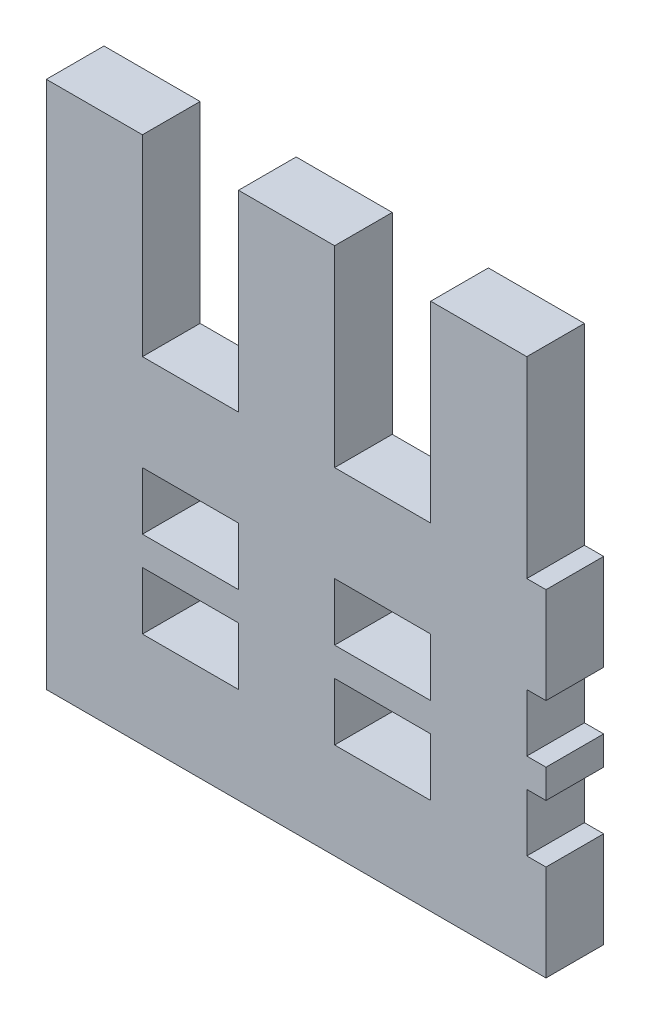
ISO-10303-21;
HEADER;
FILE_DESCRIPTION(('STEP AP214'),'2;1');
FILE_NAME('part.step','',(''),(''),'','','');
FILE_SCHEMA(('AUTOMOTIVE_DESIGN { 1 0 10303 214 1 1 1 1 }'));
ENDSEC;
DATA;
#1=APPLICATION_CONTEXT('core data for automotive mechanical design processes');
#2=APPLICATION_PROTOCOL_DEFINITION('international standard','automotive_design',2000,#1);
#3=PRODUCT_CONTEXT('',#1,'mechanical');
#4=PRODUCT('Part','Part','',(#3));
#5=PRODUCT_RELATED_PRODUCT_CATEGORY('part','',(#4));
#6=PRODUCT_DEFINITION_FORMATION('','',#4);
#7=PRODUCT_DEFINITION_CONTEXT('part definition',#1,'design');
#8=PRODUCT_DEFINITION('design','',#6,#7);
#9=PRODUCT_DEFINITION_SHAPE('','',#8);
#10=(LENGTH_UNIT() NAMED_UNIT(*) SI_UNIT(.MILLI.,.METRE.));
#11=(NAMED_UNIT(*) PLANE_ANGLE_UNIT() SI_UNIT($,.RADIAN.));
#12=(NAMED_UNIT(*) SI_UNIT($,.STERADIAN.) SOLID_ANGLE_UNIT());
#13=UNCERTAINTY_MEASURE_WITH_UNIT(LENGTH_MEASURE(1.E-05),#10,'distance_accuracy_value','');
#14=(GEOMETRIC_REPRESENTATION_CONTEXT(3) GLOBAL_UNCERTAINTY_ASSIGNED_CONTEXT((#13)) GLOBAL_UNIT_ASSIGNED_CONTEXT((#10,
#11,#12)) REPRESENTATION_CONTEXT('',''));
#15=CARTESIAN_POINT('',(0.,0.,0.));
#16=DIRECTION('',(0.,0.,1.));
#17=DIRECTION('',(1.,0.,0.));
#18=AXIS2_PLACEMENT_3D('',#15,#16,#17);
#19=CARTESIAN_POINT('',(-35.4148187720053,0.,3.));
#20=DIRECTION('',(1.,0.,0.));
#21=DIRECTION('',(0.,0.,-1.));
#22=AXIS2_PLACEMENT_3D('',#19,#20,#21);
#23=PLANE('',#22);
#24=DIRECTION('',(0.,-1.,0.));
#25=VECTOR('',#24,1.);
#26=CARTESIAN_POINT('',(-35.4148187720053,0.,0.));
#27=LINE('',#26,#25);
#28=CARTESIAN_POINT('',(-35.4148187720053,29.1386328651884,0.));
#29=VERTEX_POINT('',#28);
#30=CARTESIAN_POINT('',(-35.4148187720053,26.1386328651884,0.));
#31=VERTEX_POINT('',#30);
#32=EDGE_CURVE('E560',#29,#31,#27,.T.);
#33=ORIENTED_EDGE('',*,*,#32,.F.);
#34=DIRECTION('',(0.,0.,-1.));
#35=VECTOR('',#34,1.);
#36=CARTESIAN_POINT('',(-35.4148187720053,29.1386328651884,3.));
#37=LINE('',#36,#35);
#38=CARTESIAN_POINT('',(-35.4148187720053,29.1386328651884,3.));
#39=VERTEX_POINT('',#38);
#40=EDGE_CURVE('E11',#39,#29,#37,.T.);
#41=ORIENTED_EDGE('',*,*,#40,.F.);
#42=DIRECTION('',(0.,-1.,0.));
#43=VECTOR('',#42,1.);
#44=CARTESIAN_POINT('',(-35.4148187720053,0.,3.));
#45=LINE('',#44,#43);
#46=CARTESIAN_POINT('',(-35.4148187720053,26.1386328651884,3.));
#47=VERTEX_POINT('',#46);
#48=EDGE_CURVE('E305',#39,#47,#45,.T.);
#49=ORIENTED_EDGE('',*,*,#48,.T.);
#50=DIRECTION('',(0.,0.,-1.));
#51=VECTOR('',#50,1.);
#52=CARTESIAN_POINT('',(-35.4148187720053,26.1386328651884,3.));
#53=LINE('',#52,#51);
#54=EDGE_CURVE('E177',#47,#31,#53,.T.);
#55=ORIENTED_EDGE('',*,*,#54,.T.);
#56=EDGE_LOOP('',(#33,#41,#49,#55));
#57=FACE_BOUND('',#56,.T.);
#58=ADVANCED_FACE('F33',(#57),#23,.T.);
#59=CARTESIAN_POINT('',(0.,29.1386328651884,3.));
#60=DIRECTION('',(0.,-1.,0.));
#61=DIRECTION('',(1.,0.,0.));
#62=AXIS2_PLACEMENT_3D('',#59,#60,#61);
#63=PLANE('',#62);
#64=DIRECTION('',(-1.,0.,0.));
#65=VECTOR('',#64,1.);
#66=CARTESIAN_POINT('',(0.,29.1386328651884,0.));
#67=LINE('',#66,#65);
#68=CARTESIAN_POINT('',(-30.4148187720053,29.1386328651884,0.));
#69=VERTEX_POINT('',#68);
#70=EDGE_CURVE('E295',#69,#29,#67,.T.);
#71=ORIENTED_EDGE('',*,*,#70,.F.);
#72=DIRECTION('',(0.,0.,-1.));
#73=VECTOR('',#72,1.);
#74=CARTESIAN_POINT('',(-30.4148187720053,29.1386328651884,3.));
#75=LINE('',#74,#73);
#76=CARTESIAN_POINT('',(-30.4148187720053,29.1386328651884,3.));
#77=VERTEX_POINT('',#76);
#78=EDGE_CURVE('E43',#77,#69,#75,.T.);
#79=ORIENTED_EDGE('',*,*,#78,.F.);
#80=DIRECTION('',(-1.,0.,0.));
#81=VECTOR('',#80,1.);
#82=CARTESIAN_POINT('',(0.,29.1386328651884,3.));
#83=LINE('',#82,#81);
#84=EDGE_CURVE('E293',#77,#39,#83,.T.);
#85=ORIENTED_EDGE('',*,*,#84,.T.);
#86=ORIENTED_EDGE('',*,*,#40,.T.);
#87=EDGE_LOOP('',(#71,#79,#85,#86));
#88=FACE_BOUND('',#87,.T.);
#89=ADVANCED_FACE('F291',(#88),#63,.T.);
#90=CARTESIAN_POINT('',(-30.4148187720053,0.,3.));
#91=DIRECTION('',(1.,0.,0.));
#92=DIRECTION('',(0.,0.,-1.));
#93=AXIS2_PLACEMENT_3D('',#90,#91,#92);
#94=PLANE('',#93);
#95=DIRECTION('',(0.,-1.,0.));
#96=VECTOR('',#95,1.);
#97=CARTESIAN_POINT('',(-30.4148187720053,0.,0.));
#98=LINE('',#97,#96);
#99=CARTESIAN_POINT('',(-30.4148187720053,26.1386328651884,0.));
#100=VERTEX_POINT('',#99);
#101=EDGE_CURVE('E373',#69,#100,#98,.T.);
#102=ORIENTED_EDGE('',*,*,#101,.T.);
#103=DIRECTION('',(0.,0.,-1.));
#104=VECTOR('',#103,1.);
#105=CARTESIAN_POINT('',(-30.4148187720053,26.1386328651884,3.));
#106=LINE('',#105,#104);
#107=CARTESIAN_POINT('',(-30.4148187720053,26.1386328651884,3.));
#108=VERTEX_POINT('',#107);
#109=EDGE_CURVE('E298',#108,#100,#106,.T.);
#110=ORIENTED_EDGE('',*,*,#109,.F.);
#111=DIRECTION('',(0.,-1.,0.));
#112=VECTOR('',#111,1.);
#113=CARTESIAN_POINT('',(-30.4148187720053,0.,3.));
#114=LINE('',#113,#112);
#115=EDGE_CURVE('E301',#77,#108,#114,.T.);
#116=ORIENTED_EDGE('',*,*,#115,.F.);
#117=ORIENTED_EDGE('',*,*,#78,.T.);
#118=EDGE_LOOP('',(#102,#110,#116,#117));
#119=FACE_BOUND('',#118,.T.);
#120=ADVANCED_FACE('F302',(#119),#94,.F.);
#121=CARTESIAN_POINT('',(-40.4148187720053,29.1386328651884,0.));
#122=VERTEX_POINT('',#121);
#123=CARTESIAN_POINT('',(-45.4148187720053,29.1386328651884,0.));
#124=VERTEX_POINT('',#123);
#125=EDGE_CURVE('E566',#122,#124,#67,.T.);
#126=ORIENTED_EDGE('',*,*,#125,.F.);
#127=DIRECTION('',(0.,0.,-1.));
#128=VECTOR('',#127,1.);
#129=CARTESIAN_POINT('',(-40.4148187720053,29.1386328651884,3.));
#130=LINE('',#129,#128);
#131=CARTESIAN_POINT('',(-40.4148187720053,29.1386328651884,3.));
#132=VERTEX_POINT('',#131);
#133=EDGE_CURVE('E550',#132,#122,#130,.T.);
#134=ORIENTED_EDGE('',*,*,#133,.F.);
#135=CARTESIAN_POINT('',(-45.4148187720053,29.1386328651884,3.));
#136=VERTEX_POINT('',#135);
#137=EDGE_CURVE('E307',#132,#136,#83,.T.);
#138=ORIENTED_EDGE('',*,*,#137,.T.);
#139=DIRECTION('',(0.,0.,-1.));
#140=VECTOR('',#139,1.);
#141=CARTESIAN_POINT('',(-45.4148187720053,29.1386328651884,3.));
#142=LINE('',#141,#140);
#143=EDGE_CURVE('E544',#136,#124,#142,.T.);
#144=ORIENTED_EDGE('',*,*,#143,.T.);
#145=EDGE_LOOP('',(#126,#134,#138,#144));
#146=FACE_BOUND('',#145,.T.);
#147=ADVANCED_FACE('F605',(#146),#63,.T.);
#148=CARTESIAN_POINT('',(-40.4148187720053,0.,3.));
#149=DIRECTION('',(1.,0.,0.));
#150=DIRECTION('',(0.,1.,0.));
#151=AXIS2_PLACEMENT_3D('',#148,#149,#150);
#152=PLANE('',#151);
#153=DIRECTION('',(0.,-1.,0.));
#154=VECTOR('',#153,1.);
#155=CARTESIAN_POINT('',(-40.4148187720053,0.,0.));
#156=LINE('',#155,#154);
#157=CARTESIAN_POINT('',(-40.4148187720053,26.1386328651884,0.));
#158=VERTEX_POINT('',#157);
#159=EDGE_CURVE('E383',#122,#158,#156,.T.);
#160=ORIENTED_EDGE('',*,*,#159,.T.);
#161=DIRECTION('',(0.,0.,-1.));
#162=VECTOR('',#161,1.);
#163=CARTESIAN_POINT('',(-40.4148187720053,26.1386328651884,3.));
#164=LINE('',#163,#162);
#165=CARTESIAN_POINT('',(-40.4148187720053,26.1386328651884,3.));
#166=VERTEX_POINT('',#165);
#167=EDGE_CURVE('E552',#166,#158,#164,.T.);
#168=ORIENTED_EDGE('',*,*,#167,.F.);
#169=DIRECTION('',(0.,-1.,0.));
#170=VECTOR('',#169,1.);
#171=CARTESIAN_POINT('',(-40.4148187720053,0.,3.));
#172=LINE('',#171,#170);
#173=EDGE_CURVE('E314',#132,#166,#172,.T.);
#174=ORIENTED_EDGE('',*,*,#173,.F.);
#175=ORIENTED_EDGE('',*,*,#133,.T.);
#176=EDGE_LOOP('',(#160,#168,#174,#175));
#177=FACE_BOUND('',#176,.T.);
#178=ADVANCED_FACE('F603',(#177),#152,.F.);
#179=CARTESIAN_POINT('',(0.,26.1386328651884,3.));
#180=DIRECTION('',(0.,-1.,0.));
#181=DIRECTION('',(0.,0.,-1.));
#182=AXIS2_PLACEMENT_3D('',#179,#180,#181);
#183=PLANE('',#182);
#184=DIRECTION('',(-1.,0.,0.));
#185=VECTOR('',#184,1.);
#186=CARTESIAN_POINT('',(0.,26.1386328651884,0.));
#187=LINE('',#186,#185);
#188=CARTESIAN_POINT('',(-45.4148187720053,26.1386328651884,0.));
#189=VERTEX_POINT('',#188);
#190=EDGE_CURVE('E375',#158,#189,#187,.T.);
#191=ORIENTED_EDGE('',*,*,#190,.T.);
#192=DIRECTION('',(0.,0.,-1.));
#193=VECTOR('',#192,1.);
#194=CARTESIAN_POINT('',(-45.4148187720053,26.1386328651884,3.));
#195=LINE('',#194,#193);
#196=CARTESIAN_POINT('',(-45.4148187720053,26.1386328651884,3.));
#197=VERTEX_POINT('',#196);
#198=EDGE_CURVE('E555',#197,#189,#195,.T.);
#199=ORIENTED_EDGE('',*,*,#198,.F.);
#200=DIRECTION('',(-1.,0.,0.));
#201=VECTOR('',#200,1.);
#202=CARTESIAN_POINT('',(0.,26.1386328651884,3.));
#203=LINE('',#202,#201);
#204=EDGE_CURVE('E329',#166,#197,#203,.T.);
#205=ORIENTED_EDGE('',*,*,#204,.F.);
#206=ORIENTED_EDGE('',*,*,#167,.T.);
#207=EDGE_LOOP('',(#191,#199,#205,#206));
#208=FACE_BOUND('',#207,.T.);
#209=ADVANCED_FACE('F599',(#208),#183,.F.);
#210=CARTESIAN_POINT('',(0.,33.6386328651884,3.));
#211=DIRECTION('',(0.,1.,0.));
#212=DIRECTION('',(0.,0.,1.));
#213=AXIS2_PLACEMENT_3D('',#210,#211,#212);
#214=PLANE('',#213);
#215=DIRECTION('',(1.,0.,0.));
#216=VECTOR('',#215,1.);
#217=CARTESIAN_POINT('',(0.,33.6386328651884,0.));
#218=LINE('',#217,#216);
#219=CARTESIAN_POINT('',(-45.4148187720053,33.6386328651884,0.));
#220=VERTEX_POINT('',#219);
#221=CARTESIAN_POINT('',(-40.4148187720053,33.6386328651884,0.));
#222=VERTEX_POINT('',#221);
#223=EDGE_CURVE('E437',#220,#222,#218,.T.);
#224=ORIENTED_EDGE('',*,*,#223,.T.);
#225=DIRECTION('',(0.,0.,-1.));
#226=VECTOR('',#225,1.);
#227=CARTESIAN_POINT('',(-40.4148187720053,33.6386328651884,3.));
#228=LINE('',#227,#226);
#229=CARTESIAN_POINT('',(-40.4148187720053,33.6386328651884,3.));
#230=VERTEX_POINT('',#229);
#231=EDGE_CURVE('E541',#230,#222,#228,.T.);
#232=ORIENTED_EDGE('',*,*,#231,.F.);
#233=DIRECTION('',(1.,0.,0.));
#234=VECTOR('',#233,1.);
#235=CARTESIAN_POINT('',(0.,33.6386328651884,3.));
#236=LINE('',#235,#234);
#237=CARTESIAN_POINT('',(-45.4148187720053,33.6386328651884,3.));
#238=VERTEX_POINT('',#237);
#239=EDGE_CURVE('E369',#238,#230,#236,.T.);
#240=ORIENTED_EDGE('',*,*,#239,.F.);
#241=DIRECTION('',(0.,0.,-1.));
#242=VECTOR('',#241,1.);
#243=CARTESIAN_POINT('',(-45.4148187720053,33.6386328651884,3.));
#244=LINE('',#243,#242);
#245=EDGE_CURVE('E484',#238,#220,#244,.T.);
#246=ORIENTED_EDGE('',*,*,#245,.T.);
#247=EDGE_LOOP('',(#224,#232,#240,#246));
#248=FACE_BOUND('',#247,.T.);
#249=ADVANCED_FACE('F646',(#248),#214,.F.);
#250=CARTESIAN_POINT('',(-40.4148187720053,0.,3.));
#251=DIRECTION('',(1.,0.,0.));
#252=DIRECTION('',(0.,0.,-1.));
#253=AXIS2_PLACEMENT_3D('',#250,#251,#252);
#254=PLANE('',#253);
#255=DIRECTION('',(0.,-1.,0.));
#256=VECTOR('',#255,1.);
#257=CARTESIAN_POINT('',(-40.4148187720053,0.,0.));
#258=LINE('',#257,#256);
#259=CARTESIAN_POINT('',(-40.4148187720053,30.6386328651884,0.));
#260=VERTEX_POINT('',#259);
#261=EDGE_CURVE('E571',#222,#260,#258,.T.);
#262=ORIENTED_EDGE('',*,*,#261,.T.);
#263=DIRECTION('',(0.,0.,-1.));
#264=VECTOR('',#263,1.);
#265=CARTESIAN_POINT('',(-40.4148187720053,30.6386328651884,3.));
#266=LINE('',#265,#264);
#267=CARTESIAN_POINT('',(-40.4148187720053,30.6386328651884,3.));
#268=VERTEX_POINT('',#267);
#269=EDGE_CURVE('E545',#268,#260,#266,.T.);
#270=ORIENTED_EDGE('',*,*,#269,.F.);
#271=DIRECTION('',(0.,-1.,0.));
#272=VECTOR('',#271,1.);
#273=CARTESIAN_POINT('',(-40.4148187720053,0.,3.));
#274=LINE('',#273,#272);
#275=EDGE_CURVE('E448',#230,#268,#274,.T.);
#276=ORIENTED_EDGE('',*,*,#275,.F.);
#277=ORIENTED_EDGE('',*,*,#231,.T.);
#278=EDGE_LOOP('',(#262,#270,#276,#277));
#279=FACE_BOUND('',#278,.T.);
#280=ADVANCED_FACE('F642',(#279),#254,.F.);
#281=CARTESIAN_POINT('',(0.,30.6386328651884,3.));
#282=DIRECTION('',(0.,1.,0.));
#283=DIRECTION('',(0.,0.,1.));
#284=AXIS2_PLACEMENT_3D('',#281,#282,#283);
#285=PLANE('',#284);
#286=DIRECTION('',(1.,0.,0.));
#287=VECTOR('',#286,1.);
#288=CARTESIAN_POINT('',(0.,30.6386328651884,0.));
#289=LINE('',#288,#287);
#290=CARTESIAN_POINT('',(-45.4148187720053,30.6386328651884,0.));
#291=VERTEX_POINT('',#290);
#292=EDGE_CURVE('E570',#291,#260,#289,.T.);
#293=ORIENTED_EDGE('',*,*,#292,.F.);
#294=DIRECTION('',(0.,0.,-1.));
#295=VECTOR('',#294,1.);
#296=CARTESIAN_POINT('',(-45.4148187720053,30.6386328651884,3.));
#297=LINE('',#296,#295);
#298=CARTESIAN_POINT('',(-45.4148187720053,30.6386328651884,3.));
#299=VERTEX_POINT('',#298);
#300=EDGE_CURVE('E547',#299,#291,#297,.T.);
#301=ORIENTED_EDGE('',*,*,#300,.F.);
#302=DIRECTION('',(1.,0.,0.));
#303=VECTOR('',#302,1.);
#304=CARTESIAN_POINT('',(0.,30.6386328651884,3.));
#305=LINE('',#304,#303);
#306=EDGE_CURVE('E447',#299,#268,#305,.T.);
#307=ORIENTED_EDGE('',*,*,#306,.T.);
#308=ORIENTED_EDGE('',*,*,#269,.T.);
#309=EDGE_LOOP('',(#293,#301,#307,#308));
#310=FACE_BOUND('',#309,.T.);
#311=ADVANCED_FACE('F638',(#310),#285,.T.);
#312=CARTESIAN_POINT('',(-35.4148187720052,0.,3.));
#313=DIRECTION('',(1.,0.,0.));
#314=DIRECTION('',(0.,1.,0.));
#315=AXIS2_PLACEMENT_3D('',#312,#313,#314);
#316=PLANE('',#315);
#317=DIRECTION('',(0.,-1.,0.));
#318=VECTOR('',#317,1.);
#319=CARTESIAN_POINT('',(-35.4148187720052,0.,0.));
#320=LINE('',#319,#318);
#321=CARTESIAN_POINT('',(-35.4148187720053,33.6386328651884,0.));
#322=VERTEX_POINT('',#321);
#323=CARTESIAN_POINT('',(-35.4148187720053,30.6386328651884,0.));
#324=VERTEX_POINT('',#323);
#325=EDGE_CURVE('E577',#322,#324,#320,.T.);
#326=ORIENTED_EDGE('',*,*,#325,.F.);
#327=DIRECTION('',(0.,0.,-1.));
#328=VECTOR('',#327,1.);
#329=CARTESIAN_POINT('',(-35.4148187720053,33.6386328651884,3.));
#330=LINE('',#329,#328);
#331=CARTESIAN_POINT('',(-35.4148187720053,33.6386328651884,3.));
#332=VERTEX_POINT('',#331);
#333=EDGE_CURVE('E481',#332,#322,#330,.T.);
#334=ORIENTED_EDGE('',*,*,#333,.F.);
#335=DIRECTION('',(0.,-1.,0.));
#336=VECTOR('',#335,1.);
#337=CARTESIAN_POINT('',(-35.4148187720052,0.,3.));
#338=LINE('',#337,#336);
#339=CARTESIAN_POINT('',(-35.4148187720053,30.6386328651884,3.));
#340=VERTEX_POINT('',#339);
#341=EDGE_CURVE('E453',#332,#340,#338,.T.);
#342=ORIENTED_EDGE('',*,*,#341,.T.);
#343=DIRECTION('',(0.,0.,-1.));
#344=VECTOR('',#343,1.);
#345=CARTESIAN_POINT('',(-35.4148187720053,30.6386328651884,3.));
#346=LINE('',#345,#344);
#347=EDGE_CURVE('E486',#340,#324,#346,.T.);
#348=ORIENTED_EDGE('',*,*,#347,.T.);
#349=EDGE_LOOP('',(#326,#334,#342,#348));
#350=FACE_BOUND('',#349,.T.);
#351=ADVANCED_FACE('F641',(#350),#316,.T.);
#352=CARTESIAN_POINT('',(-30.4148187720054,33.6386328651884,0.));
#353=VERTEX_POINT('',#352);
#354=EDGE_CURVE('E438',#322,#353,#218,.T.);
#355=ORIENTED_EDGE('',*,*,#354,.T.);
#356=DIRECTION('',(0.,0.,-1.));
#357=VECTOR('',#356,1.);
#358=CARTESIAN_POINT('',(-30.4148187720054,33.6386328651884,3.));
#359=LINE('',#358,#357);
#360=CARTESIAN_POINT('',(-30.4148187720054,33.6386328651884,3.));
#361=VERTEX_POINT('',#360);
#362=EDGE_CURVE('E476',#361,#353,#359,.T.);
#363=ORIENTED_EDGE('',*,*,#362,.F.);
#364=EDGE_CURVE('E370',#332,#361,#236,.T.);
#365=ORIENTED_EDGE('',*,*,#364,.F.);
#366=ORIENTED_EDGE('',*,*,#333,.T.);
#367=EDGE_LOOP('',(#355,#363,#365,#366));
#368=FACE_BOUND('',#367,.T.);
#369=ADVANCED_FACE('F477',(#368),#214,.F.);
#370=CARTESIAN_POINT('',(-30.4148187720053,0.,3.));
#371=DIRECTION('',(1.,0.,0.));
#372=DIRECTION('',(0.,1.,0.));
#373=AXIS2_PLACEMENT_3D('',#370,#371,#372);
#374=PLANE('',#373);
#375=DIRECTION('',(0.,-1.,0.));
#376=VECTOR('',#375,1.);
#377=CARTESIAN_POINT('',(-30.4148187720053,0.,0.));
#378=LINE('',#377,#376);
#379=CARTESIAN_POINT('',(-30.4148187720053,30.6386328651884,0.));
#380=VERTEX_POINT('',#379);
#381=EDGE_CURVE('E574',#353,#380,#378,.T.);
#382=ORIENTED_EDGE('',*,*,#381,.T.);
#383=DIRECTION('',(0.,0.,-1.));
#384=VECTOR('',#383,1.);
#385=CARTESIAN_POINT('',(-30.4148187720053,30.6386328651884,3.));
#386=LINE('',#385,#384);
#387=CARTESIAN_POINT('',(-30.4148187720053,30.6386328651884,3.));
#388=VERTEX_POINT('',#387);
#389=EDGE_CURVE('E482',#388,#380,#386,.T.);
#390=ORIENTED_EDGE('',*,*,#389,.F.);
#391=DIRECTION('',(0.,-1.,0.));
#392=VECTOR('',#391,1.);
#393=CARTESIAN_POINT('',(-30.4148187720053,0.,3.));
#394=LINE('',#393,#392);
#395=EDGE_CURVE('E450',#361,#388,#394,.T.);
#396=ORIENTED_EDGE('',*,*,#395,.F.);
#397=ORIENTED_EDGE('',*,*,#362,.T.);
#398=EDGE_LOOP('',(#382,#390,#396,#397));
#399=FACE_BOUND('',#398,.T.);
#400=ADVANCED_FACE('F652',(#399),#374,.F.);
#401=CARTESIAN_POINT('',(-25.4148187720053,0.,3.));
#402=DIRECTION('',(1.,0.,0.));
#403=DIRECTION('',(0.,0.,-1.));
#404=AXIS2_PLACEMENT_3D('',#401,#402,#403);
#405=PLANE('',#404);
#406=DIRECTION('',(0.,-1.,0.));
#407=VECTOR('',#406,1.);
#408=CARTESIAN_POINT('',(-25.4148187720053,0.,0.));
#409=LINE('',#408,#407);
#410=CARTESIAN_POINT('',(-25.4148187720053,33.6386328651884,0.));
#411=VERTEX_POINT('',#410);
#412=CARTESIAN_POINT('',(-25.4148187720053,30.6386328651884,0.));
#413=VERTEX_POINT('',#412);
#414=EDGE_CURVE('E436',#411,#413,#409,.T.);
#415=ORIENTED_EDGE('',*,*,#414,.F.);
#416=DIRECTION('',(0.,0.,-1.));
#417=VECTOR('',#416,1.);
#418=CARTESIAN_POINT('',(-25.4148187720053,33.6386328651884,3.));
#419=LINE('',#418,#417);
#420=CARTESIAN_POINT('',(-25.4148187720053,33.6386328651884,3.));
#421=VERTEX_POINT('',#420);
#422=EDGE_CURVE('E37',#421,#411,#419,.T.);
#423=ORIENTED_EDGE('',*,*,#422,.F.);
#424=DIRECTION('',(0.,-1.,0.));
#425=VECTOR('',#424,1.);
#426=CARTESIAN_POINT('',(-25.4148187720053,0.,3.));
#427=LINE('',#426,#425);
#428=CARTESIAN_POINT('',(-25.4148187720053,30.6386328651884,3.));
#429=VERTEX_POINT('',#428);
#430=EDGE_CURVE('E368',#421,#429,#427,.T.);
#431=ORIENTED_EDGE('',*,*,#430,.T.);
#432=DIRECTION('',(0.,0.,-1.));
#433=VECTOR('',#432,1.);
#434=CARTESIAN_POINT('',(-25.4148187720053,30.6386328651884,3.));
#435=LINE('',#434,#433);
#436=EDGE_CURVE('E490',#429,#413,#435,.T.);
#437=ORIENTED_EDGE('',*,*,#436,.T.);
#438=EDGE_LOOP('',(#415,#423,#431,#437));
#439=FACE_BOUND('',#438,.T.);
#440=ADVANCED_FACE('F35',(#439),#405,.T.);
#441=CARTESIAN_POINT('',(-24.4148187720053,33.6386328651884,0.));
#442=VERTEX_POINT('',#441);
#443=EDGE_CURVE('E434',#411,#442,#218,.T.);
#444=ORIENTED_EDGE('',*,*,#443,.T.);
#445=DIRECTION('',(0.,0.,-1.));
#446=VECTOR('',#445,1.);
#447=CARTESIAN_POINT('',(-24.4148187720053,33.6386328651884,3.));
#448=LINE('',#447,#446);
#449=CARTESIAN_POINT('',(-24.4148187720053,33.6386328651884,3.));
#450=VERTEX_POINT('',#449);
#451=EDGE_CURVE('E529',#450,#442,#448,.T.);
#452=ORIENTED_EDGE('',*,*,#451,.F.);
#453=EDGE_CURVE('E366',#421,#450,#236,.T.);
#454=ORIENTED_EDGE('',*,*,#453,.F.);
#455=ORIENTED_EDGE('',*,*,#422,.T.);
#456=EDGE_LOOP('',(#444,#452,#454,#455));
#457=FACE_BOUND('',#456,.T.);
#458=ADVANCED_FACE('F651',(#457),#214,.F.);
#459=CARTESIAN_POINT('',(-24.4148187720053,0.,3.));
#460=DIRECTION('',(-1.,0.,0.));
#461=DIRECTION('',(0.,-1.,0.));
#462=AXIS2_PLACEMENT_3D('',#459,#460,#461);
#463=PLANE('',#462);
#464=DIRECTION('',(0.,1.,0.));
#465=VECTOR('',#464,1.);
#466=CARTESIAN_POINT('',(-24.4148187720053,0.,0.));
#467=LINE('',#466,#465);
#468=CARTESIAN_POINT('',(-24.4148187720053,38.6386328651884,0.));
#469=VERTEX_POINT('',#468);
#470=EDGE_CURVE('E431',#442,#469,#467,.T.);
#471=ORIENTED_EDGE('',*,*,#470,.T.);
#472=DIRECTION('',(0.,0.,-1.));
#473=VECTOR('',#472,1.);
#474=CARTESIAN_POINT('',(-24.4148187720053,38.6386328651884,3.));
#475=LINE('',#474,#473);
#476=CARTESIAN_POINT('',(-24.4148187720053,38.6386328651884,3.));
#477=VERTEX_POINT('',#476);
#478=EDGE_CURVE('E528',#477,#469,#475,.T.);
#479=ORIENTED_EDGE('',*,*,#478,.F.);
#480=DIRECTION('',(0.,1.,0.));
#481=VECTOR('',#480,1.);
#482=CARTESIAN_POINT('',(-24.4148187720053,0.,3.));
#483=LINE('',#482,#481);
#484=EDGE_CURVE('E364',#450,#477,#483,.T.);
#485=ORIENTED_EDGE('',*,*,#484,.F.);
#486=ORIENTED_EDGE('',*,*,#451,.T.);
#487=EDGE_LOOP('',(#471,#479,#485,#486));
#488=FACE_BOUND('',#487,.T.);
#489=ADVANCED_FACE('F712',(#488),#463,.F.);
#490=CARTESIAN_POINT('',(0.,38.6386328651884,3.));
#491=DIRECTION('',(0.,1.,0.));
#492=DIRECTION('',(-1.,0.,0.));
#493=AXIS2_PLACEMENT_3D('',#490,#491,#492);
#494=PLANE('',#493);
#495=DIRECTION('',(1.,0.,0.));
#496=VECTOR('',#495,1.);
#497=CARTESIAN_POINT('',(0.,38.6386328651884,0.));
#498=LINE('',#497,#496);
#499=CARTESIAN_POINT('',(-25.4148187720053,38.6386328651884,0.));
#500=VERTEX_POINT('',#499);
#501=EDGE_CURVE('E428',#500,#469,#498,.T.);
#502=ORIENTED_EDGE('',*,*,#501,.F.);
#503=DIRECTION('',(0.,0.,-1.));
#504=VECTOR('',#503,1.);
#505=CARTESIAN_POINT('',(-25.4148187720053,38.6386328651884,3.));
#506=LINE('',#505,#504);
#507=CARTESIAN_POINT('',(-25.4148187720053,38.6386328651884,3.));
#508=VERTEX_POINT('',#507);
#509=EDGE_CURVE('E526',#508,#500,#506,.T.);
#510=ORIENTED_EDGE('',*,*,#509,.F.);
#511=DIRECTION('',(1.,0.,0.));
#512=VECTOR('',#511,1.);
#513=CARTESIAN_POINT('',(0.,38.6386328651884,3.));
#514=LINE('',#513,#512);
#515=EDGE_CURVE('E361',#508,#477,#514,.T.);
#516=ORIENTED_EDGE('',*,*,#515,.T.);
#517=ORIENTED_EDGE('',*,*,#478,.T.);
#518=EDGE_LOOP('',(#502,#510,#516,#517));
#519=FACE_BOUND('',#518,.T.);
#520=ADVANCED_FACE('F688',(#519),#494,.T.);
#521=CARTESIAN_POINT('',(-25.4148187720053,0.,3.));
#522=DIRECTION('',(-1.,0.,0.));
#523=DIRECTION('',(0.,0.,1.));
#524=AXIS2_PLACEMENT_3D('',#521,#522,#523);
#525=PLANE('',#524);
#526=DIRECTION('',(0.,1.,0.));
#527=VECTOR('',#526,1.);
#528=CARTESIAN_POINT('',(-25.4148187720053,0.,0.));
#529=LINE('',#528,#527);
#530=CARTESIAN_POINT('',(-25.4148187720053,48.6386328651884,0.));
#531=VERTEX_POINT('',#530);
#532=EDGE_CURVE('E425',#500,#531,#529,.T.);
#533=ORIENTED_EDGE('',*,*,#532,.T.);
#534=DIRECTION('',(0.,0.,-1.));
#535=VECTOR('',#534,1.);
#536=CARTESIAN_POINT('',(-25.4148187720053,48.6386328651884,3.));
#537=LINE('',#536,#535);
#538=CARTESIAN_POINT('',(-25.4148187720053,48.6386328651884,3.));
#539=VERTEX_POINT('',#538);
#540=EDGE_CURVE('E524',#539,#531,#537,.T.);
#541=ORIENTED_EDGE('',*,*,#540,.F.);
#542=DIRECTION('',(0.,1.,0.));
#543=VECTOR('',#542,1.);
#544=CARTESIAN_POINT('',(-25.4148187720053,0.,3.));
#545=LINE('',#544,#543);
#546=EDGE_CURVE('E359',#508,#539,#545,.T.);
#547=ORIENTED_EDGE('',*,*,#546,.F.);
#548=ORIENTED_EDGE('',*,*,#509,.T.);
#549=EDGE_LOOP('',(#533,#541,#547,#548));
#550=FACE_BOUND('',#549,.T.);
#551=ADVANCED_FACE('F708',(#550),#525,.F.);
#552=CARTESIAN_POINT('',(0.,48.6386328651884,3.));
#553=DIRECTION('',(0.,1.,0.));
#554=DIRECTION('',(0.,0.,1.));
#555=AXIS2_PLACEMENT_3D('',#552,#553,#554);
#556=PLANE('',#555);
#557=DIRECTION('',(1.,0.,0.));
#558=VECTOR('',#557,1.);
#559=CARTESIAN_POINT('',(0.,48.6386328651884,0.));
#560=LINE('',#559,#558);
#561=CARTESIAN_POINT('',(-30.4148187720053,48.6386328651884,0.));
#562=VERTEX_POINT('',#561);
#563=EDGE_CURVE('E422',#562,#531,#560,.T.);
#564=ORIENTED_EDGE('',*,*,#563,.F.);
#565=DIRECTION('',(0.,0.,-1.));
#566=VECTOR('',#565,1.);
#567=CARTESIAN_POINT('',(-30.4148187720053,48.6386328651884,3.));
#568=LINE('',#567,#566);
#569=CARTESIAN_POINT('',(-30.4148187720053,48.6386328651884,3.));
#570=VERTEX_POINT('',#569);
#571=EDGE_CURVE('E522',#570,#562,#568,.T.);
#572=ORIENTED_EDGE('',*,*,#571,.F.);
#573=DIRECTION('',(1.,0.,0.));
#574=VECTOR('',#573,1.);
#575=CARTESIAN_POINT('',(0.,48.6386328651884,3.));
#576=LINE('',#575,#574);
#577=EDGE_CURVE('E356',#570,#539,#576,.T.);
#578=ORIENTED_EDGE('',*,*,#577,.T.);
#579=ORIENTED_EDGE('',*,*,#540,.T.);
#580=EDGE_LOOP('',(#564,#572,#578,#579));
#581=FACE_BOUND('',#580,.T.);
#582=ADVANCED_FACE('F704',(#581),#556,.T.);
#583=CARTESIAN_POINT('',(-30.4148187720053,0.,3.));
#584=DIRECTION('',(-1.,0.,0.));
#585=DIRECTION('',(0.,-1.,0.));
#586=AXIS2_PLACEMENT_3D('',#583,#584,#585);
#587=PLANE('',#586);
#588=DIRECTION('',(0.,1.,0.));
#589=VECTOR('',#588,1.);
#590=CARTESIAN_POINT('',(-30.4148187720053,0.,0.));
#591=LINE('',#590,#589);
#592=CARTESIAN_POINT('',(-30.4148187720053,38.6386328651884,0.));
#593=VERTEX_POINT('',#592);
#594=EDGE_CURVE('E419',#593,#562,#591,.T.);
#595=ORIENTED_EDGE('',*,*,#594,.F.);
#596=DIRECTION('',(0.,0.,-1.));
#597=VECTOR('',#596,1.);
#598=CARTESIAN_POINT('',(-30.4148187720053,38.6386328651884,3.));
#599=LINE('',#598,#597);
#600=CARTESIAN_POINT('',(-30.4148187720053,38.6386328651884,3.));
#601=VERTEX_POINT('',#600);
#602=EDGE_CURVE('E520',#601,#593,#599,.T.);
#603=ORIENTED_EDGE('',*,*,#602,.F.);
#604=DIRECTION('',(0.,1.,0.));
#605=VECTOR('',#604,1.);
#606=CARTESIAN_POINT('',(-30.4148187720053,0.,3.));
#607=LINE('',#606,#605);
#608=EDGE_CURVE('E353',#601,#570,#607,.T.);
#609=ORIENTED_EDGE('',*,*,#608,.T.);
#610=ORIENTED_EDGE('',*,*,#571,.T.);
#611=EDGE_LOOP('',(#595,#603,#609,#610));
#612=FACE_BOUND('',#611,.T.);
#613=ADVANCED_FACE('F701',(#612),#587,.T.);
#614=CARTESIAN_POINT('',(-35.4148187720053,38.6386328651884,0.));
#615=VERTEX_POINT('',#614);
#616=EDGE_CURVE('E418',#615,#593,#498,.T.);
#617=ORIENTED_EDGE('',*,*,#616,.F.);
#618=DIRECTION('',(0.,0.,-1.));
#619=VECTOR('',#618,1.);
#620=CARTESIAN_POINT('',(-35.4148187720053,38.6386328651884,3.));
#621=LINE('',#620,#619);
#622=CARTESIAN_POINT('',(-35.4148187720053,38.6386328651884,3.));
#623=VERTEX_POINT('',#622);
#624=EDGE_CURVE('E518',#623,#615,#621,.T.);
#625=ORIENTED_EDGE('',*,*,#624,.F.);
#626=EDGE_CURVE('E352',#623,#601,#514,.T.);
#627=ORIENTED_EDGE('',*,*,#626,.T.);
#628=ORIENTED_EDGE('',*,*,#602,.T.);
#629=EDGE_LOOP('',(#617,#625,#627,#628));
#630=FACE_BOUND('',#629,.T.);
#631=ADVANCED_FACE('F689',(#630),#494,.T.);
#632=CARTESIAN_POINT('',(-35.4148187720053,0.,3.));
#633=DIRECTION('',(-1.,0.,0.));
#634=DIRECTION('',(0.,0.,1.));
#635=AXIS2_PLACEMENT_3D('',#632,#633,#634);
#636=PLANE('',#635);
#637=DIRECTION('',(0.,1.,0.));
#638=VECTOR('',#637,1.);
#639=CARTESIAN_POINT('',(-35.4148187720053,0.,0.));
#640=LINE('',#639,#638);
#641=CARTESIAN_POINT('',(-35.4148187720053,48.6386328651884,0.));
#642=VERTEX_POINT('',#641);
#643=EDGE_CURVE('E415',#615,#642,#640,.T.);
#644=ORIENTED_EDGE('',*,*,#643,.T.);
#645=DIRECTION('',(0.,0.,-1.));
#646=VECTOR('',#645,1.);
#647=CARTESIAN_POINT('',(-35.4148187720053,48.6386328651884,3.));
#648=LINE('',#647,#646);
#649=CARTESIAN_POINT('',(-35.4148187720053,48.6386328651884,3.));
#650=VERTEX_POINT('',#649);
#651=EDGE_CURVE('E516',#650,#642,#648,.T.);
#652=ORIENTED_EDGE('',*,*,#651,.F.);
#653=DIRECTION('',(0.,1.,0.));
#654=VECTOR('',#653,1.);
#655=CARTESIAN_POINT('',(-35.4148187720053,0.,3.));
#656=LINE('',#655,#654);
#657=EDGE_CURVE('E350',#623,#650,#656,.T.);
#658=ORIENTED_EDGE('',*,*,#657,.F.);
#659=ORIENTED_EDGE('',*,*,#624,.T.);
#660=EDGE_LOOP('',(#644,#652,#658,#659));
#661=FACE_BOUND('',#660,.T.);
#662=ADVANCED_FACE('F696',(#661),#636,.F.);
#663=CARTESIAN_POINT('',(0.,48.6386328651884,3.));
#664=DIRECTION('',(0.,1.,0.));
#665=DIRECTION('',(0.,0.,1.));
#666=AXIS2_PLACEMENT_3D('',#663,#664,#665);
#667=PLANE('',#666);
#668=DIRECTION('',(1.,0.,0.));
#669=VECTOR('',#668,1.);
#670=CARTESIAN_POINT('',(0.,48.6386328651884,0.));
#671=LINE('',#670,#669);
#672=CARTESIAN_POINT('',(-40.4148187720053,48.6386328651884,0.));
#673=VERTEX_POINT('',#672);
#674=EDGE_CURVE('E412',#673,#642,#671,.T.);
#675=ORIENTED_EDGE('',*,*,#674,.F.);
#676=DIRECTION('',(0.,0.,-1.));
#677=VECTOR('',#676,1.);
#678=CARTESIAN_POINT('',(-40.4148187720053,48.6386328651884,3.));
#679=LINE('',#678,#677);
#680=CARTESIAN_POINT('',(-40.4148187720053,48.6386328651884,3.));
#681=VERTEX_POINT('',#680);
#682=EDGE_CURVE('E514',#681,#673,#679,.T.);
#683=ORIENTED_EDGE('',*,*,#682,.F.);
#684=DIRECTION('',(1.,0.,0.));
#685=VECTOR('',#684,1.);
#686=CARTESIAN_POINT('',(0.,48.6386328651884,3.));
#687=LINE('',#686,#685);
#688=EDGE_CURVE('E347',#681,#650,#687,.T.);
#689=ORIENTED_EDGE('',*,*,#688,.T.);
#690=ORIENTED_EDGE('',*,*,#651,.T.);
#691=EDGE_LOOP('',(#675,#683,#689,#690));
#692=FACE_BOUND('',#691,.T.);
#693=ADVANCED_FACE('F692',(#692),#667,.T.);
#694=CARTESIAN_POINT('',(-40.4148187720053,0.,3.));
#695=DIRECTION('',(-1.,0.,0.));
#696=DIRECTION('',(0.,-1.,0.));
#697=AXIS2_PLACEMENT_3D('',#694,#695,#696);
#698=PLANE('',#697);
#699=DIRECTION('',(0.,1.,0.));
#700=VECTOR('',#699,1.);
#701=CARTESIAN_POINT('',(-40.4148187720053,0.,0.));
#702=LINE('',#701,#700);
#703=CARTESIAN_POINT('',(-40.4148187720053,38.6386328651883,0.));
#704=VERTEX_POINT('',#703);
#705=EDGE_CURVE('E409',#704,#673,#702,.T.);
#706=ORIENTED_EDGE('',*,*,#705,.F.);
#707=DIRECTION('',(0.,0.,-1.));
#708=VECTOR('',#707,1.);
#709=CARTESIAN_POINT('',(-40.4148187720053,38.6386328651883,3.));
#710=LINE('',#709,#708);
#711=CARTESIAN_POINT('',(-40.4148187720053,38.6386328651883,3.));
#712=VERTEX_POINT('',#711);
#713=EDGE_CURVE('E512',#712,#704,#710,.T.);
#714=ORIENTED_EDGE('',*,*,#713,.F.);
#715=DIRECTION('',(0.,1.,0.));
#716=VECTOR('',#715,1.);
#717=CARTESIAN_POINT('',(-40.4148187720053,0.,3.));
#718=LINE('',#717,#716);
#719=EDGE_CURVE('E344',#712,#681,#718,.T.);
#720=ORIENTED_EDGE('',*,*,#719,.T.);
#721=ORIENTED_EDGE('',*,*,#682,.T.);
#722=EDGE_LOOP('',(#706,#714,#720,#721));
#723=FACE_BOUND('',#722,.T.);
#724=ADVANCED_FACE('F686',(#723),#698,.T.);
#725=CARTESIAN_POINT('',(-45.4148187720053,38.6386328651883,0.));
#726=VERTEX_POINT('',#725);
#727=EDGE_CURVE('E408',#726,#704,#498,.T.);
#728=ORIENTED_EDGE('',*,*,#727,.F.);
#729=DIRECTION('',(0.,0.,-1.));
#730=VECTOR('',#729,1.);
#731=CARTESIAN_POINT('',(-45.4148187720053,38.6386328651883,3.));
#732=LINE('',#731,#730);
#733=CARTESIAN_POINT('',(-45.4148187720053,38.6386328651883,3.));
#734=VERTEX_POINT('',#733);
#735=EDGE_CURVE('E510',#734,#726,#732,.T.);
#736=ORIENTED_EDGE('',*,*,#735,.F.);
#737=EDGE_CURVE('E343',#734,#712,#514,.T.);
#738=ORIENTED_EDGE('',*,*,#737,.T.);
#739=ORIENTED_EDGE('',*,*,#713,.T.);
#740=EDGE_LOOP('',(#728,#736,#738,#739));
#741=FACE_BOUND('',#740,.T.);
#742=ADVANCED_FACE('F682',(#741),#494,.T.);
#743=CARTESIAN_POINT('',(-45.4148187720053,0.,3.));
#744=DIRECTION('',(-1.,0.,0.));
#745=DIRECTION('',(0.,0.,1.));
#746=AXIS2_PLACEMENT_3D('',#743,#744,#745);
#747=PLANE('',#746);
#748=DIRECTION('',(0.,1.,0.));
#749=VECTOR('',#748,1.);
#750=CARTESIAN_POINT('',(-45.4148187720053,0.,0.));
#751=LINE('',#750,#749);
#752=CARTESIAN_POINT('',(-45.4148187720053,48.6386328651884,0.));
#753=VERTEX_POINT('',#752);
#754=EDGE_CURVE('E405',#726,#753,#751,.T.);
#755=ORIENTED_EDGE('',*,*,#754,.T.);
#756=DIRECTION('',(0.,0.,-1.));
#757=VECTOR('',#756,1.);
#758=CARTESIAN_POINT('',(-45.4148187720053,48.6386328651884,3.));
#759=LINE('',#758,#757);
#760=CARTESIAN_POINT('',(-45.4148187720053,48.6386328651884,3.));
#761=VERTEX_POINT('',#760);
#762=EDGE_CURVE('E508',#761,#753,#759,.T.);
#763=ORIENTED_EDGE('',*,*,#762,.F.);
#764=DIRECTION('',(0.,1.,0.));
#765=VECTOR('',#764,1.);
#766=CARTESIAN_POINT('',(-45.4148187720053,0.,3.));
#767=LINE('',#766,#765);
#768=EDGE_CURVE('E341',#734,#761,#767,.T.);
#769=ORIENTED_EDGE('',*,*,#768,.F.);
#770=ORIENTED_EDGE('',*,*,#735,.T.);
#771=EDGE_LOOP('',(#755,#763,#769,#770));
#772=FACE_BOUND('',#771,.T.);
#773=ADVANCED_FACE('F678',(#772),#747,.F.);
#774=CARTESIAN_POINT('',(0.,48.6386328651884,3.));
#775=DIRECTION('',(0.,1.,0.));
#776=DIRECTION('',(0.,0.,1.));
#777=AXIS2_PLACEMENT_3D('',#774,#775,#776);
#778=PLANE('',#777);
#779=DIRECTION('',(1.,0.,0.));
#780=VECTOR('',#779,1.);
#781=CARTESIAN_POINT('',(0.,48.6386328651884,0.));
#782=LINE('',#781,#780);
#783=CARTESIAN_POINT('',(-50.4148187720053,48.6386328651884,0.));
#784=VERTEX_POINT('',#783);
#785=EDGE_CURVE('E402',#784,#753,#782,.T.);
#786=ORIENTED_EDGE('',*,*,#785,.F.);
#787=DIRECTION('',(0.,0.,-1.));
#788=VECTOR('',#787,1.);
#789=CARTESIAN_POINT('',(-50.4148187720053,48.6386328651884,3.));
#790=LINE('',#789,#788);
#791=CARTESIAN_POINT('',(-50.4148187720053,48.6386328651884,3.));
#792=VERTEX_POINT('',#791);
#793=EDGE_CURVE('E506',#792,#784,#790,.T.);
#794=ORIENTED_EDGE('',*,*,#793,.F.);
#795=DIRECTION('',(1.,0.,0.));
#796=VECTOR('',#795,1.);
#797=CARTESIAN_POINT('',(0.,48.6386328651884,3.));
#798=LINE('',#797,#796);
#799=EDGE_CURVE('E338',#792,#761,#798,.T.);
#800=ORIENTED_EDGE('',*,*,#799,.T.);
#801=ORIENTED_EDGE('',*,*,#762,.T.);
#802=EDGE_LOOP('',(#786,#794,#800,#801));
#803=FACE_BOUND('',#802,.T.);
#804=ADVANCED_FACE('F674',(#803),#778,.T.);
#805=CARTESIAN_POINT('',(-50.4148187720053,0.,3.));
#806=DIRECTION('',(1.,0.,0.));
#807=DIRECTION('',(0.,0.,-1.));
#808=AXIS2_PLACEMENT_3D('',#805,#806,#807);
#809=PLANE('',#808);
#810=DIRECTION('',(0.,-1.,0.));
#811=VECTOR('',#810,1.);
#812=CARTESIAN_POINT('',(-50.4148187720053,0.,0.));
#813=LINE('',#812,#811);
#814=CARTESIAN_POINT('',(-50.4148187720053,21.1386328651884,0.));
#815=VERTEX_POINT('',#814);
#816=EDGE_CURVE('E397',#784,#815,#813,.T.);
#817=ORIENTED_EDGE('',*,*,#816,.T.);
#818=DIRECTION('',(0.,0.,-1.));
#819=VECTOR('',#818,1.);
#820=CARTESIAN_POINT('',(-50.4148187720053,21.1386328651884,3.));
#821=LINE('',#820,#819);
#822=CARTESIAN_POINT('',(-50.4148187720053,21.1386328651884,3.));
#823=VERTEX_POINT('',#822);
#824=EDGE_CURVE('E504',#823,#815,#821,.T.);
#825=ORIENTED_EDGE('',*,*,#824,.F.);
#826=DIRECTION('',(0.,-1.,0.));
#827=VECTOR('',#826,1.);
#828=CARTESIAN_POINT('',(-50.4148187720053,0.,3.));
#829=LINE('',#828,#827);
#830=EDGE_CURVE('E336',#792,#823,#829,.T.);
#831=ORIENTED_EDGE('',*,*,#830,.F.);
#832=ORIENTED_EDGE('',*,*,#793,.T.);
#833=EDGE_LOOP('',(#817,#825,#831,#832));
#834=FACE_BOUND('',#833,.T.);
#835=ADVANCED_FACE('F670',(#834),#809,.F.);
#836=CARTESIAN_POINT('',(0.,21.1386328651884,3.));
#837=DIRECTION('',(0.,-1.,0.));
#838=DIRECTION('',(0.,0.,-1.));
#839=AXIS2_PLACEMENT_3D('',#836,#837,#838);
#840=PLANE('',#839);
#841=DIRECTION('',(-1.,0.,0.));
#842=VECTOR('',#841,1.);
#843=CARTESIAN_POINT('',(0.,21.1386328651884,0.));
#844=LINE('',#843,#842);
#845=CARTESIAN_POINT('',(-24.4148187720053,21.1386328651884,0.));
#846=VERTEX_POINT('',#845);
#847=EDGE_CURVE('E393',#846,#815,#844,.T.);
#848=ORIENTED_EDGE('',*,*,#847,.F.);
#849=DIRECTION('',(0.,0.,-1.));
#850=VECTOR('',#849,1.);
#851=CARTESIAN_POINT('',(-24.4148187720053,21.1386328651884,3.));
#852=LINE('',#851,#850);
#853=CARTESIAN_POINT('',(-24.4148187720053,21.1386328651884,3.));
#854=VERTEX_POINT('',#853);
#855=EDGE_CURVE('E502',#854,#846,#852,.T.);
#856=ORIENTED_EDGE('',*,*,#855,.F.);
#857=DIRECTION('',(-1.,0.,0.));
#858=VECTOR('',#857,1.);
#859=CARTESIAN_POINT('',(0.,21.1386328651884,3.));
#860=LINE('',#859,#858);
#861=EDGE_CURVE('E333',#854,#823,#860,.T.);
#862=ORIENTED_EDGE('',*,*,#861,.T.);
#863=ORIENTED_EDGE('',*,*,#824,.T.);
#864=EDGE_LOOP('',(#848,#856,#862,#863));
#865=FACE_BOUND('',#864,.T.);
#866=ADVANCED_FACE('F666',(#865),#840,.T.);
#867=CARTESIAN_POINT('',(-24.4148187720053,0.,3.));
#868=DIRECTION('',(1.,0.,0.));
#869=DIRECTION('',(0.,0.,-1.));
#870=AXIS2_PLACEMENT_3D('',#867,#868,#869);
#871=PLANE('',#870);
#872=DIRECTION('',(0.,-1.,0.));
#873=VECTOR('',#872,1.);
#874=CARTESIAN_POINT('',(-24.4148187720053,0.,0.));
#875=LINE('',#874,#873);
#876=CARTESIAN_POINT('',(-24.4148187720053,26.1386328651884,0.));
#877=VERTEX_POINT('',#876);
#878=EDGE_CURVE('E386',#877,#846,#875,.T.);
#879=ORIENTED_EDGE('',*,*,#878,.F.);
#880=DIRECTION('',(0.,0.,-1.));
#881=VECTOR('',#880,1.);
#882=CARTESIAN_POINT('',(-24.4148187720053,26.1386328651884,3.));
#883=LINE('',#882,#881);
#884=CARTESIAN_POINT('',(-24.4148187720053,26.1386328651884,3.));
#885=VERTEX_POINT('',#884);
#886=EDGE_CURVE('E500',#885,#877,#883,.T.);
#887=ORIENTED_EDGE('',*,*,#886,.F.);
#888=DIRECTION('',(0.,-1.,0.));
#889=VECTOR('',#888,1.);
#890=CARTESIAN_POINT('',(-24.4148187720053,0.,3.));
#891=LINE('',#890,#889);
#892=EDGE_CURVE('E327',#885,#854,#891,.T.);
#893=ORIENTED_EDGE('',*,*,#892,.T.);
#894=ORIENTED_EDGE('',*,*,#855,.T.);
#895=EDGE_LOOP('',(#879,#887,#893,#894));
#896=FACE_BOUND('',#895,.T.);
#897=ADVANCED_FACE('F663',(#896),#871,.T.);
#898=CARTESIAN_POINT('',(-25.4148187720053,26.1386328651884,0.));
#899=VERTEX_POINT('',#898);
#900=EDGE_CURVE('E376',#877,#899,#187,.T.);
#901=ORIENTED_EDGE('',*,*,#900,.T.);
#902=DIRECTION('',(0.,0.,-1.));
#903=VECTOR('',#902,1.);
#904=CARTESIAN_POINT('',(-25.4148187720053,26.1386328651884,3.));
#905=LINE('',#904,#903);
#906=CARTESIAN_POINT('',(-25.4148187720053,26.1386328651884,3.));
#907=VERTEX_POINT('',#906);
#908=EDGE_CURVE('E498',#907,#899,#905,.T.);
#909=ORIENTED_EDGE('',*,*,#908,.F.);
#910=EDGE_CURVE('E324',#885,#907,#203,.T.);
#911=ORIENTED_EDGE('',*,*,#910,.F.);
#912=ORIENTED_EDGE('',*,*,#886,.T.);
#913=EDGE_LOOP('',(#901,#909,#911,#912));
#914=FACE_BOUND('',#913,.T.);
#915=ADVANCED_FACE('F618',(#914),#183,.F.);
#916=CARTESIAN_POINT('',(-25.4148187720053,0.,3.));
#917=DIRECTION('',(1.,0.,0.));
#918=DIRECTION('',(0.,0.,-1.));
#919=AXIS2_PLACEMENT_3D('',#916,#917,#918);
#920=PLANE('',#919);
#921=DIRECTION('',(0.,-1.,0.));
#922=VECTOR('',#921,1.);
#923=CARTESIAN_POINT('',(-25.4148187720053,0.,0.));
#924=LINE('',#923,#922);
#925=CARTESIAN_POINT('',(-25.4148187720053,29.1386328651884,0.));
#926=VERTEX_POINT('',#925);
#927=EDGE_CURVE('E385',#926,#899,#924,.T.);
#928=ORIENTED_EDGE('',*,*,#927,.F.);
#929=DIRECTION('',(0.,0.,-1.));
#930=VECTOR('',#929,1.);
#931=CARTESIAN_POINT('',(-25.4148187720053,29.1386328651884,3.));
#932=LINE('',#931,#930);
#933=CARTESIAN_POINT('',(-25.4148187720053,29.1386328651884,3.));
#934=VERTEX_POINT('',#933);
#935=EDGE_CURVE('E496',#934,#926,#932,.T.);
#936=ORIENTED_EDGE('',*,*,#935,.F.);
#937=DIRECTION('',(0.,-1.,0.));
#938=VECTOR('',#937,1.);
#939=CARTESIAN_POINT('',(-25.4148187720053,0.,3.));
#940=LINE('',#939,#938);
#941=EDGE_CURVE('E318',#934,#907,#940,.T.);
#942=ORIENTED_EDGE('',*,*,#941,.T.);
#943=ORIENTED_EDGE('',*,*,#908,.T.);
#944=EDGE_LOOP('',(#928,#936,#942,#943));
#945=FACE_BOUND('',#944,.T.);
#946=ADVANCED_FACE('F660',(#945),#920,.T.);
#947=CARTESIAN_POINT('',(-24.4148187720053,29.1386328651884,0.));
#948=VERTEX_POINT('',#947);
#949=EDGE_CURVE('E391',#948,#926,#67,.T.);
#950=ORIENTED_EDGE('',*,*,#949,.F.);
#951=DIRECTION('',(0.,0.,-1.));
#952=VECTOR('',#951,1.);
#953=CARTESIAN_POINT('',(-24.4148187720053,29.1386328651884,3.));
#954=LINE('',#953,#952);
#955=CARTESIAN_POINT('',(-24.4148187720053,29.1386328651884,3.));
#956=VERTEX_POINT('',#955);
#957=EDGE_CURVE('E494',#956,#948,#954,.T.);
#958=ORIENTED_EDGE('',*,*,#957,.F.);
#959=EDGE_CURVE('E308',#956,#934,#83,.T.);
#960=ORIENTED_EDGE('',*,*,#959,.T.);
#961=ORIENTED_EDGE('',*,*,#935,.T.);
#962=EDGE_LOOP('',(#950,#958,#960,#961));
#963=FACE_BOUND('',#962,.T.);
#964=ADVANCED_FACE('F625',(#963),#63,.T.);
#965=CARTESIAN_POINT('',(-24.4148187720053,0.,3.));
#966=DIRECTION('',(1.,0.,0.));
#967=DIRECTION('',(0.,0.,-1.));
#968=AXIS2_PLACEMENT_3D('',#965,#966,#967);
#969=PLANE('',#968);
#970=DIRECTION('',(0.,-1.,0.));
#971=VECTOR('',#970,1.);
#972=CARTESIAN_POINT('',(-24.4148187720053,0.,0.));
#973=LINE('',#972,#971);
#974=CARTESIAN_POINT('',(-24.4148187720053,30.6386328651884,0.));
#975=VERTEX_POINT('',#974);
#976=EDGE_CURVE('E582',#975,#948,#973,.T.);
#977=ORIENTED_EDGE('',*,*,#976,.F.);
#978=DIRECTION('',(0.,0.,-1.));
#979=VECTOR('',#978,1.);
#980=CARTESIAN_POINT('',(-24.4148187720053,30.6386328651884,3.));
#981=LINE('',#980,#979);
#982=CARTESIAN_POINT('',(-24.4148187720053,30.6386328651884,3.));
#983=VERTEX_POINT('',#982);
#984=EDGE_CURVE('E492',#983,#975,#981,.T.);
#985=ORIENTED_EDGE('',*,*,#984,.F.);
#986=DIRECTION('',(0.,-1.,0.));
#987=VECTOR('',#986,1.);
#988=CARTESIAN_POINT('',(-24.4148187720053,0.,3.));
#989=LINE('',#988,#987);
#990=EDGE_CURVE('E317',#983,#956,#989,.T.);
#991=ORIENTED_EDGE('',*,*,#990,.T.);
#992=ORIENTED_EDGE('',*,*,#957,.T.);
#993=EDGE_LOOP('',(#977,#985,#991,#992));
#994=FACE_BOUND('',#993,.T.);
#995=ADVANCED_FACE('F631',(#994),#969,.T.);
#996=CARTESIAN_POINT('',(-45.4148187720053,0.,3.));
#997=DIRECTION('',(1.,0.,0.));
#998=DIRECTION('',(0.,0.,-1.));
#999=AXIS2_PLACEMENT_3D('',#996,#997,#998);
#1000=PLANE('',#999);
#1001=DIRECTION('',(0.,-1.,0.));
#1002=VECTOR('',#1001,1.);
#1003=CARTESIAN_POINT('',(-45.4148187720053,0.,0.));
#1004=LINE('',#1003,#1002);
#1005=EDGE_CURVE('E382',#124,#189,#1004,.T.);
#1006=ORIENTED_EDGE('',*,*,#1005,.F.);
#1007=ORIENTED_EDGE('',*,*,#143,.F.);
#1008=DIRECTION('',(0.,-1.,0.));
#1009=VECTOR('',#1008,1.);
#1010=CARTESIAN_POINT('',(-45.4148187720053,0.,3.));
#1011=LINE('',#1010,#1009);
#1012=EDGE_CURVE('E309',#136,#197,#1011,.T.);
#1013=ORIENTED_EDGE('',*,*,#1012,.T.);
#1014=ORIENTED_EDGE('',*,*,#198,.T.);
#1015=EDGE_LOOP('',(#1006,#1007,#1013,#1014));
#1016=FACE_BOUND('',#1015,.T.);
#1017=ADVANCED_FACE('F595',(#1016),#1000,.T.);
#1018=CARTESIAN_POINT('',(-45.4148187720053,0.,3.));
#1019=DIRECTION('',(1.,0.,0.));
#1020=DIRECTION('',(0.,0.,-1.));
#1021=AXIS2_PLACEMENT_3D('',#1018,#1019,#1020);
#1022=PLANE('',#1021);
#1023=DIRECTION('',(0.,-1.,0.));
#1024=VECTOR('',#1023,1.);
#1025=CARTESIAN_POINT('',(-45.4148187720053,0.,0.));
#1026=LINE('',#1025,#1024);
#1027=EDGE_CURVE('E567',#220,#291,#1026,.T.);
#1028=ORIENTED_EDGE('',*,*,#1027,.F.);
#1029=ORIENTED_EDGE('',*,*,#245,.F.);
#1030=DIRECTION('',(0.,-1.,0.));
#1031=VECTOR('',#1030,1.);
#1032=CARTESIAN_POINT('',(-45.4148187720053,0.,3.));
#1033=LINE('',#1032,#1031);
#1034=EDGE_CURVE('E315',#238,#299,#1033,.T.);
#1035=ORIENTED_EDGE('',*,*,#1034,.T.);
#1036=ORIENTED_EDGE('',*,*,#300,.T.);
#1037=EDGE_LOOP('',(#1028,#1029,#1035,#1036));
#1038=FACE_BOUND('',#1037,.T.);
#1039=ADVANCED_FACE('F630',(#1038),#1022,.T.);
#1040=EDGE_CURVE('E576',#324,#380,#289,.T.);
#1041=ORIENTED_EDGE('',*,*,#1040,.F.);
#1042=ORIENTED_EDGE('',*,*,#347,.F.);
#1043=EDGE_CURVE('E452',#340,#388,#305,.T.);
#1044=ORIENTED_EDGE('',*,*,#1043,.T.);
#1045=ORIENTED_EDGE('',*,*,#389,.T.);
#1046=EDGE_LOOP('',(#1041,#1042,#1044,#1045));
#1047=FACE_BOUND('',#1046,.T.);
#1048=ADVANCED_FACE('F636',(#1047),#285,.T.);
#1049=EDGE_CURVE('E579',#413,#975,#289,.T.);
#1050=ORIENTED_EDGE('',*,*,#1049,.F.);
#1051=ORIENTED_EDGE('',*,*,#436,.F.);
#1052=EDGE_CURVE('E322',#429,#983,#305,.T.);
#1053=ORIENTED_EDGE('',*,*,#1052,.T.);
#1054=ORIENTED_EDGE('',*,*,#984,.T.);
#1055=EDGE_LOOP('',(#1050,#1051,#1053,#1054));
#1056=FACE_BOUND('',#1055,.T.);
#1057=ADVANCED_FACE('F616',(#1056),#285,.T.);
#1058=EDGE_CURVE('E170',#100,#31,#187,.T.);
#1059=ORIENTED_EDGE('',*,*,#1058,.T.);
#1060=ORIENTED_EDGE('',*,*,#54,.F.);
#1061=EDGE_CURVE('E52',#108,#47,#203,.T.);
#1062=ORIENTED_EDGE('',*,*,#1061,.F.);
#1063=ORIENTED_EDGE('',*,*,#109,.T.);
#1064=EDGE_LOOP('',(#1059,#1060,#1062,#1063));
#1065=FACE_BOUND('',#1064,.T.);
#1066=ADVANCED_FACE('F608',(#1065),#183,.F.);
#1067=CARTESIAN_POINT('',(0.,0.,3.));
#1068=DIRECTION('',(0.,0.,1.));
#1069=DIRECTION('',(1.,0.,0.));
#1070=AXIS2_PLACEMENT_3D('',#1067,#1068,#1069);
#1071=PLANE('',#1070);
#1072=ORIENTED_EDGE('',*,*,#430,.F.);
#1073=ORIENTED_EDGE('',*,*,#453,.T.);
#1074=ORIENTED_EDGE('',*,*,#484,.T.);
#1075=ORIENTED_EDGE('',*,*,#515,.F.);
#1076=ORIENTED_EDGE('',*,*,#546,.T.);
#1077=ORIENTED_EDGE('',*,*,#577,.F.);
#1078=ORIENTED_EDGE('',*,*,#608,.F.);
#1079=ORIENTED_EDGE('',*,*,#626,.F.);
#1080=ORIENTED_EDGE('',*,*,#657,.T.);
#1081=ORIENTED_EDGE('',*,*,#688,.F.);
#1082=ORIENTED_EDGE('',*,*,#719,.F.);
#1083=ORIENTED_EDGE('',*,*,#737,.F.);
#1084=ORIENTED_EDGE('',*,*,#768,.T.);
#1085=ORIENTED_EDGE('',*,*,#799,.F.);
#1086=ORIENTED_EDGE('',*,*,#830,.T.);
#1087=ORIENTED_EDGE('',*,*,#861,.F.);
#1088=ORIENTED_EDGE('',*,*,#892,.F.);
#1089=ORIENTED_EDGE('',*,*,#910,.T.);
#1090=ORIENTED_EDGE('',*,*,#941,.F.);
#1091=ORIENTED_EDGE('',*,*,#959,.F.);
#1092=ORIENTED_EDGE('',*,*,#990,.F.);
#1093=ORIENTED_EDGE('',*,*,#1052,.F.);
#1094=EDGE_LOOP('',(#1072,#1073,#1074,#1075,#1076,#1077,#1078,#1079,#1080,#1081,#1082,#1083,
#1084,#1085,#1086,#1087,#1088,#1089,#1090,#1091,#1092,#1093));
#1095=FACE_BOUND('',#1094,.T.);
#1096=ORIENTED_EDGE('',*,*,#341,.F.);
#1097=ORIENTED_EDGE('',*,*,#364,.T.);
#1098=ORIENTED_EDGE('',*,*,#395,.T.);
#1099=ORIENTED_EDGE('',*,*,#1043,.F.);
#1100=EDGE_LOOP('',(#1096,#1097,#1098,#1099));
#1101=FACE_BOUND('',#1100,.T.);
#1102=ORIENTED_EDGE('',*,*,#239,.T.);
#1103=ORIENTED_EDGE('',*,*,#275,.T.);
#1104=ORIENTED_EDGE('',*,*,#306,.F.);
#1105=ORIENTED_EDGE('',*,*,#1034,.F.);
#1106=EDGE_LOOP('',(#1102,#1103,#1104,#1105));
#1107=FACE_BOUND('',#1106,.T.);
#1108=ORIENTED_EDGE('',*,*,#137,.F.);
#1109=ORIENTED_EDGE('',*,*,#173,.T.);
#1110=ORIENTED_EDGE('',*,*,#204,.T.);
#1111=ORIENTED_EDGE('',*,*,#1012,.F.);
#1112=EDGE_LOOP('',(#1108,#1109,#1110,#1111));
#1113=FACE_BOUND('',#1112,.T.);
#1114=ORIENTED_EDGE('',*,*,#48,.F.);
#1115=ORIENTED_EDGE('',*,*,#84,.F.);
#1116=ORIENTED_EDGE('',*,*,#115,.T.);
#1117=ORIENTED_EDGE('',*,*,#1061,.T.);
#1118=EDGE_LOOP('',(#1114,#1115,#1116,#1117));
#1119=FACE_BOUND('',#1118,.T.);
#1120=ADVANCED_FACE('F304',(#1095,#1101,#1107,#1113,#1119),#1071,.T.);
#1121=CARTESIAN_POINT('',(0.,0.,0.));
#1122=DIRECTION('',(0.,0.,1.));
#1123=DIRECTION('',(1.,0.,0.));
#1124=AXIS2_PLACEMENT_3D('',#1121,#1122,#1123);
#1125=PLANE('',#1124);
#1126=ORIENTED_EDGE('',*,*,#414,.T.);
#1127=ORIENTED_EDGE('',*,*,#1049,.T.);
#1128=ORIENTED_EDGE('',*,*,#976,.T.);
#1129=ORIENTED_EDGE('',*,*,#949,.T.);
#1130=ORIENTED_EDGE('',*,*,#927,.T.);
#1131=ORIENTED_EDGE('',*,*,#900,.F.);
#1132=ORIENTED_EDGE('',*,*,#878,.T.);
#1133=ORIENTED_EDGE('',*,*,#847,.T.);
#1134=ORIENTED_EDGE('',*,*,#816,.F.);
#1135=ORIENTED_EDGE('',*,*,#785,.T.);
#1136=ORIENTED_EDGE('',*,*,#754,.F.);
#1137=ORIENTED_EDGE('',*,*,#727,.T.);
#1138=ORIENTED_EDGE('',*,*,#705,.T.);
#1139=ORIENTED_EDGE('',*,*,#674,.T.);
#1140=ORIENTED_EDGE('',*,*,#643,.F.);
#1141=ORIENTED_EDGE('',*,*,#616,.T.);
#1142=ORIENTED_EDGE('',*,*,#594,.T.);
#1143=ORIENTED_EDGE('',*,*,#563,.T.);
#1144=ORIENTED_EDGE('',*,*,#532,.F.);
#1145=ORIENTED_EDGE('',*,*,#501,.T.);
#1146=ORIENTED_EDGE('',*,*,#470,.F.);
#1147=ORIENTED_EDGE('',*,*,#443,.F.);
#1148=EDGE_LOOP('',(#1126,#1127,#1128,#1129,#1130,#1131,#1132,#1133,#1134,#1135,#1136,#1137,
#1138,#1139,#1140,#1141,#1142,#1143,#1144,#1145,#1146,#1147));
#1149=FACE_BOUND('',#1148,.T.);
#1150=ORIENTED_EDGE('',*,*,#325,.T.);
#1151=ORIENTED_EDGE('',*,*,#1040,.T.);
#1152=ORIENTED_EDGE('',*,*,#381,.F.);
#1153=ORIENTED_EDGE('',*,*,#354,.F.);
#1154=EDGE_LOOP('',(#1150,#1151,#1152,#1153));
#1155=FACE_BOUND('',#1154,.T.);
#1156=ORIENTED_EDGE('',*,*,#223,.F.);
#1157=ORIENTED_EDGE('',*,*,#1027,.T.);
#1158=ORIENTED_EDGE('',*,*,#292,.T.);
#1159=ORIENTED_EDGE('',*,*,#261,.F.);
#1160=EDGE_LOOP('',(#1156,#1157,#1158,#1159));
#1161=FACE_BOUND('',#1160,.T.);
#1162=ORIENTED_EDGE('',*,*,#125,.T.);
#1163=ORIENTED_EDGE('',*,*,#1005,.T.);
#1164=ORIENTED_EDGE('',*,*,#190,.F.);
#1165=ORIENTED_EDGE('',*,*,#159,.F.);
#1166=EDGE_LOOP('',(#1162,#1163,#1164,#1165));
#1167=FACE_BOUND('',#1166,.T.);
#1168=ORIENTED_EDGE('',*,*,#32,.T.);
#1169=ORIENTED_EDGE('',*,*,#1058,.F.);
#1170=ORIENTED_EDGE('',*,*,#101,.F.);
#1171=ORIENTED_EDGE('',*,*,#70,.T.);
#1172=EDGE_LOOP('',(#1168,#1169,#1170,#1171));
#1173=FACE_BOUND('',#1172,.T.);
#1174=ADVANCED_FACE('F592',(#1149,#1155,#1161,#1167,#1173),#1125,.F.);
#1175=CLOSED_SHELL('',(#58,#89,#120,#147,#178,#209,#249,#280,#311,#351,#369,#400,#440,#458,#489,
#520,#551,#582,#613,#631,#662,#693,#724,#742,#773,#804,#835,#866,#897,#915,#946,#964,#995,#1017,
#1039,#1048,#1057,#1066,#1120,#1174));
#1176=MANIFOLD_SOLID_BREP('B2',#1175);
#1177=ADVANCED_BREP_SHAPE_REPRESENTATION('',(#18,#1176),#14);
#1178=SHAPE_DEFINITION_REPRESENTATION(#9,#1177);
ENDSEC;
END-ISO-10303-21;
